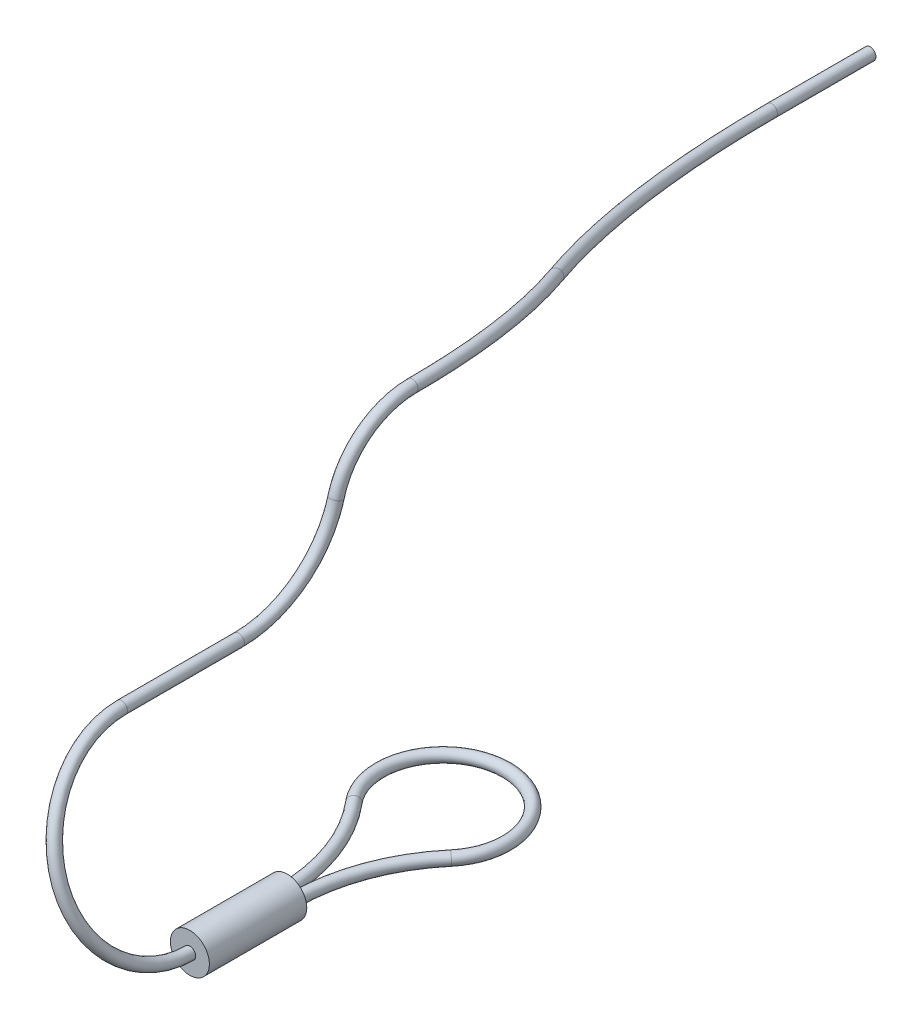
ISO-10303-21;
HEADER;
FILE_DESCRIPTION(('STEP AP214'),'2;1');
FILE_NAME('part.step','',(''),(''),'','','');
FILE_SCHEMA(('AUTOMOTIVE_DESIGN { 1 0 10303 214 1 1 1 1 }'));
ENDSEC;
DATA;
#1=APPLICATION_CONTEXT('core data for automotive mechanical design processes');
#2=APPLICATION_PROTOCOL_DEFINITION('international standard','automotive_design',2000,#1);
#3=PRODUCT_CONTEXT('',#1,'mechanical');
#4=PRODUCT('Part','Part','',(#3));
#5=PRODUCT_RELATED_PRODUCT_CATEGORY('part','',(#4));
#6=PRODUCT_DEFINITION_FORMATION('','',#4);
#7=PRODUCT_DEFINITION_CONTEXT('part definition',#1,'design');
#8=PRODUCT_DEFINITION('design','',#6,#7);
#9=PRODUCT_DEFINITION_SHAPE('','',#8);
#10=(LENGTH_UNIT() NAMED_UNIT(*) SI_UNIT(.MILLI.,.METRE.));
#11=(NAMED_UNIT(*) PLANE_ANGLE_UNIT() SI_UNIT($,.RADIAN.));
#12=(NAMED_UNIT(*) SI_UNIT($,.STERADIAN.) SOLID_ANGLE_UNIT());
#13=UNCERTAINTY_MEASURE_WITH_UNIT(LENGTH_MEASURE(1.E-05),#10,'distance_accuracy_value','');
#14=(GEOMETRIC_REPRESENTATION_CONTEXT(3) GLOBAL_UNCERTAINTY_ASSIGNED_CONTEXT((#13)) GLOBAL_UNIT_ASSIGNED_CONTEXT((#10,
#11,#12)) REPRESENTATION_CONTEXT('',''));
#15=CARTESIAN_POINT('',(0.,0.,0.));
#16=DIRECTION('',(0.,0.,1.));
#17=DIRECTION('',(1.,0.,0.));
#18=AXIS2_PLACEMENT_3D('',#15,#16,#17);
#19=CARTESIAN_POINT('',(10.,-13.,14.));
#20=DIRECTION('',(0.,0.,1.));
#21=DIRECTION('',(1.,0.,0.));
#22=AXIS2_PLACEMENT_3D('',#19,#20,#21);
#23=PLANE('',#22);
#24=CARTESIAN_POINT('',(10.,-13.,14.));
#25=DIRECTION('',(0.,0.,1.));
#26=DIRECTION('',(1.,0.,0.));
#27=AXIS2_PLACEMENT_3D('',#24,#25,#26);
#28=CIRCLE('',#27,0.999999999999999);
#29=CARTESIAN_POINT('',(11.,-13.,14.));
#30=VERTEX_POINT('',#29);
#31=EDGE_CURVE('E48',#30,#30,#28,.T.);
#32=ORIENTED_EDGE('',*,*,#31,.T.);
#33=EDGE_LOOP('',(#32));
#34=FACE_BOUND('',#33,.T.);
#35=CARTESIAN_POINT('',(10.,-13.,14.));
#36=DIRECTION('',(0.,0.,1.));
#37=DIRECTION('',(1.,0.,0.));
#38=AXIS2_PLACEMENT_3D('',#35,#36,#37);
#39=CIRCLE('',#38,0.3);
#40=CARTESIAN_POINT('',(10.1070441180227,-13.280252665994,14.));
#41=VERTEX_POINT('',#40);
#42=EDGE_CURVE('E57',#41,#41,#39,.T.);
#43=ORIENTED_EDGE('',*,*,#42,.F.);
#44=EDGE_LOOP('',(#43));
#45=FACE_BOUND('',#44,.T.);
#46=ADVANCED_FACE('F28',(#34,#45),#23,.T.);
#47=CARTESIAN_POINT('',(0.52232905982905,-13.,9.00000000000001));
#48=DIRECTION('',(0.,-1.,0.));
#49=DIRECTION('',(0.,0.,-1.));
#50=AXIS2_PLACEMENT_3D('',#47,#48,#49);
#51=TOROIDAL_SURFACE('',#50,9.15267094017095,0.3);
#52=CARTESIAN_POINT('',(7.5164679685414,-13.,3.09632264900209));
#53=DIRECTION('',(-0.645022353539104,0.,-0.764163701987261));
#54=DIRECTION('',(-0.764163701987261,0.,0.645022353539104));
#55=AXIS2_PLACEMENT_3D('',#52,#53,#54);
#56=CIRCLE('',#55,0.3);
#57=CARTESIAN_POINT('',(7.74571707913758,-13.,2.90281594294036));
#58=VERTEX_POINT('',#57);
#59=EDGE_CURVE('E10',#58,#58,#56,.T.);
#60=CARTESIAN_POINT('',(9.675,-13.,9.00000000000001));
#61=DIRECTION('',(0.,0.,1.));
#62=DIRECTION('',(1.,0.,0.));
#63=AXIS2_PLACEMENT_3D('',#60,#61,#62);
#64=CIRCLE('',#63,0.3);
#65=CARTESIAN_POINT('',(9.975,-13.,9.00000000000001));
#66=VERTEX_POINT('',#65);
#67=EDGE_CURVE('E43',#66,#66,#64,.T.);
#68=CARTESIAN_POINT('',(0.52232905982905,-13.,9.00000000000001));
#69=DIRECTION('',(0.,-1.,0.));
#70=DIRECTION('',(0.,0.,-1.));
#71=AXIS2_PLACEMENT_3D('',#68,#69,#70);
#72=CIRCLE('',#71,9.45267094017095);
#73=EDGE_CURVE('',#58,#66,#72,.T.);
#74=ORIENTED_EDGE('',*,*,#59,.F.);
#75=ORIENTED_EDGE('',*,*,#67,.F.);
#76=ORIENTED_EDGE('',*,*,#73,.T.);
#77=ORIENTED_EDGE('',*,*,#73,.F.);
#78=EDGE_LOOP('',(#74,#76,#75,#77));
#79=FACE_BOUND('',#78,.T.);
#80=ADVANCED_FACE('F30',(#79),#51,.T.);
#81=CARTESIAN_POINT('',(10.,-13.,1.));
#82=DIRECTION('',(0.,1.,0.));
#83=DIRECTION('',(0.,0.,1.));
#84=AXIS2_PLACEMENT_3D('',#81,#82,#83);
#85=TOROIDAL_SURFACE('',#84,3.25,0.3);
#86=CARTESIAN_POINT('',(12.4835320314586,-13.,3.09632264900206));
#87=DIRECTION('',(-0.645022353539095,0.,0.764163701987269));
#88=DIRECTION('',(0.764163701987269,0.,0.645022353539095));
#89=AXIS2_PLACEMENT_3D('',#86,#87,#88);
#90=CIRCLE('',#89,0.3);
#91=CARTESIAN_POINT('',(12.2542829208624,-13.,2.90281594294033));
#92=VERTEX_POINT('',#91);
#93=EDGE_CURVE('E35',#92,#92,#90,.T.);
#94=ORIENTED_EDGE('',*,*,#93,.F.);
#95=EDGE_LOOP('',(#94));
#96=FACE_BOUND('',#95,.T.);
#97=ORIENTED_EDGE('',*,*,#59,.T.);
#98=EDGE_LOOP('',(#97));
#99=FACE_BOUND('',#98,.T.);
#100=ADVANCED_FACE('F111',(#96,#99),#85,.T.);
#101=CARTESIAN_POINT('',(19.4776709401709,-13.,9.));
#102=DIRECTION('',(0.,1.,0.));
#103=DIRECTION('',(0.,0.,1.));
#104=AXIS2_PLACEMENT_3D('',#101,#102,#103);
#105=TOROIDAL_SURFACE('',#104,9.15267094017095,0.3);
#106=CARTESIAN_POINT('',(10.325,-13.,9.));
#107=DIRECTION('',(0.,0.,1.));
#108=DIRECTION('',(1.,0.,0.));
#109=AXIS2_PLACEMENT_3D('',#106,#107,#108);
#110=CIRCLE('',#109,0.3);
#111=CARTESIAN_POINT('',(10.025,-13.,9.));
#112=VERTEX_POINT('',#111);
#113=EDGE_CURVE('E39',#112,#112,#110,.T.);
#114=CARTESIAN_POINT('',(19.4776709401709,-13.,9.));
#115=DIRECTION('',(0.,1.,0.));
#116=DIRECTION('',(0.,0.,1.));
#117=AXIS2_PLACEMENT_3D('',#114,#115,#116);
#118=CIRCLE('',#117,9.45267094017095);
#119=EDGE_CURVE('',#92,#112,#118,.T.);
#120=ORIENTED_EDGE('',*,*,#93,.T.);
#121=ORIENTED_EDGE('',*,*,#113,.F.);
#122=ORIENTED_EDGE('',*,*,#119,.T.);
#123=ORIENTED_EDGE('',*,*,#119,.F.);
#124=EDGE_LOOP('',(#120,#122,#121,#123));
#125=FACE_BOUND('',#124,.T.);
#126=ADVANCED_FACE('F120',(#125),#105,.T.);
#127=CARTESIAN_POINT('',(10.,-13.,9.));
#128=DIRECTION('',(0.,0.,1.));
#129=DIRECTION('',(1.,0.,0.));
#130=AXIS2_PLACEMENT_3D('',#127,#128,#129);
#131=PLANE('',#130);
#132=CARTESIAN_POINT('',(10.,-13.,9.));
#133=DIRECTION('',(0.,0.,1.));
#134=DIRECTION('',(1.,0.,0.));
#135=AXIS2_PLACEMENT_3D('',#132,#133,#134);
#136=CIRCLE('',#135,0.999999999999999);
#137=CARTESIAN_POINT('',(11.,-13.,9.));
#138=VERTEX_POINT('',#137);
#139=EDGE_CURVE('E51',#138,#138,#136,.T.);
#140=ORIENTED_EDGE('',*,*,#139,.F.);
#141=EDGE_LOOP('',(#140));
#142=FACE_BOUND('',#141,.T.);
#143=ORIENTED_EDGE('',*,*,#113,.T.);
#144=EDGE_LOOP('',(#143));
#145=FACE_BOUND('',#144,.T.);
#146=ORIENTED_EDGE('',*,*,#67,.T.);
#147=EDGE_LOOP('',(#146));
#148=FACE_BOUND('',#147,.T.);
#149=ADVANCED_FACE('F116',(#142,#145,#148),#131,.F.);
#150=CARTESIAN_POINT('',(10.,-13.,14.));
#151=DIRECTION('',(0.,0.,-1.));
#152=DIRECTION('',(-1.,0.,0.));
#153=AXIS2_PLACEMENT_3D('',#150,#151,#152);
#154=CYLINDRICAL_SURFACE('',#153,0.999999999999999);
#155=ORIENTED_EDGE('',*,*,#31,.F.);
#156=EDGE_LOOP('',(#155));
#157=FACE_BOUND('',#156,.T.);
#158=ORIENTED_EDGE('',*,*,#139,.T.);
#159=EDGE_LOOP('',(#158));
#160=FACE_BOUND('',#159,.T.);
#161=ADVANCED_FACE('F102',(#157,#160),#154,.T.);
#162=CARTESIAN_POINT('',(8.25,-8.41831746994741,14.));
#163=DIRECTION('',(0.93417555331332,0.356813726742334,0.));
#164=DIRECTION('',(-0.356813726742334,0.93417555331332,0.));
#165=AXIS2_PLACEMENT_3D('',#162,#163,#164);
#166=TOROIDAL_SURFACE('',#165,4.90451983441693,0.3);
#167=CARTESIAN_POINT('',(6.5,-3.83663493989482,14.));
#168=DIRECTION('',(0.,0.,-1.));
#169=DIRECTION('',(0.745367928816494,0.666653321218615,0.));
#170=AXIS2_PLACEMENT_3D('',#167,#168,#169);
#171=CIRCLE('',#170,0.3);
#172=CARTESIAN_POINT('',(6.3929558819773,-3.55638227390083,14.));
#173=VERTEX_POINT('',#172);
#174=EDGE_CURVE('E54',#173,#173,#171,.T.);
#175=CARTESIAN_POINT('',(8.25,-8.41831746994741,14.));
#176=DIRECTION('',(0.93417555331332,0.356813726742334,0.));
#177=DIRECTION('',(-0.356813726742334,0.93417555331332,0.));
#178=AXIS2_PLACEMENT_3D('',#175,#176,#177);
#179=CIRCLE('',#178,5.20451983441693);
#180=EDGE_CURVE('',#173,#41,#179,.T.);
#181=ORIENTED_EDGE('',*,*,#174,.F.);
#182=ORIENTED_EDGE('',*,*,#42,.T.);
#183=ORIENTED_EDGE('',*,*,#180,.T.);
#184=ORIENTED_EDGE('',*,*,#180,.F.);
#185=EDGE_LOOP('',(#181,#183,#182,#184));
#186=FACE_BOUND('',#185,.T.);
#187=ADVANCED_FACE('F92',(#186),#166,.T.);
#188=CARTESIAN_POINT('',(6.5,-1.04759455862561,-0.909676118523621));
#189=DIRECTION('',(-1.,0.,0.));
#190=DIRECTION('',(0.,0.,1.));
#191=AXIS2_PLACEMENT_3D('',#188,#189,#190);
#192=TOROIDAL_SURFACE('',#191,4.04759455862563,0.300000000000023);
#193=CARTESIAN_POINT('',(6.5,0.,2.99999999999999));
#194=DIRECTION('',(0.,0.965925826289069,-0.258819045102518));
#195=DIRECTION('',(-1.,0.,0.));
#196=AXIS2_PLACEMENT_3D('',#193,#194,#195);
#197=CIRCLE('',#196,0.300000000000023);
#198=CARTESIAN_POINT('',(6.5,0.0776457135307405,3.28977774788674));
#199=VERTEX_POINT('',#198);
#200=EDGE_CURVE('E63',#199,#199,#197,.T.);
#201=CARTESIAN_POINT('',(6.5,3.00000000000003,-0.909676118523605));
#202=DIRECTION('',(0.,0.,-1.));
#203=DIRECTION('',(-1.,0.,0.));
#204=AXIS2_PLACEMENT_3D('',#201,#202,#203);
#205=CIRCLE('',#204,0.300000000000023);
#206=CARTESIAN_POINT('',(6.5,3.30000000000005,-0.909676118523603));
#207=VERTEX_POINT('',#206);
#208=EDGE_CURVE('E60',#207,#207,#205,.T.);
#209=CARTESIAN_POINT('',(6.5,-1.04759455862561,-0.909676118523621));
#210=DIRECTION('',(-1.,0.,0.));
#211=DIRECTION('',(0.,0.,1.));
#212=AXIS2_PLACEMENT_3D('',#209,#210,#211);
#213=CIRCLE('',#212,4.34759455862565);
#214=EDGE_CURVE('',#199,#207,#213,.T.);
#215=ORIENTED_EDGE('',*,*,#200,.T.);
#216=ORIENTED_EDGE('',*,*,#208,.F.);
#217=ORIENTED_EDGE('',*,*,#214,.T.);
#218=ORIENTED_EDGE('',*,*,#214,.F.);
#219=EDGE_LOOP('',(#215,#217,#216,#218));
#220=FACE_BOUND('',#219,.T.);
#221=ADVANCED_FACE('F89',(#220),#192,.T.);
#222=CARTESIAN_POINT('',(6.5,1.3397459621556,8.));
#223=DIRECTION('',(1.,0.,0.));
#224=DIRECTION('',(0.,0.,-1.));
#225=AXIS2_PLACEMENT_3D('',#222,#223,#224);
#226=TOROIDAL_SURFACE('',#225,5.17638090205042,0.300000000000023);
#227=CARTESIAN_POINT('',(6.5,-3.83663493989482,8.00000000000001));
#228=DIRECTION('',(0.,0.,-1.));
#229=DIRECTION('',(-1.,0.,0.));
#230=AXIS2_PLACEMENT_3D('',#227,#228,#229);
#231=CIRCLE('',#230,0.300000000000023);
#232=CARTESIAN_POINT('',(6.19999999999998,-3.83663493989482,8.00000000000001));
#233=VERTEX_POINT('',#232);
#234=EDGE_CURVE('E66',#233,#233,#231,.T.);
#235=ORIENTED_EDGE('',*,*,#234,.T.);
#236=EDGE_LOOP('',(#235));
#237=FACE_BOUND('',#236,.T.);
#238=ORIENTED_EDGE('',*,*,#200,.F.);
#239=EDGE_LOOP('',(#238));
#240=FACE_BOUND('',#239,.T.);
#241=ADVANCED_FACE('F91',(#237,#240),#226,.T.);
#242=CARTESIAN_POINT('',(6.5,-3.83663493989482,8.00000000000001));
#243=DIRECTION('',(0.,0.,1.));
#244=DIRECTION('',(0.,-1.,0.));
#245=AXIS2_PLACEMENT_3D('',#242,#243,#244);
#246=CYLINDRICAL_SURFACE('',#245,0.300000000000023);
#247=ORIENTED_EDGE('',*,*,#234,.F.);
#248=EDGE_LOOP('',(#247));
#249=FACE_BOUND('',#248,.T.);
#250=ORIENTED_EDGE('',*,*,#174,.T.);
#251=EDGE_LOOP('',(#250));
#252=FACE_BOUND('',#251,.T.);
#253=ADVANCED_FACE('F99',(#249,#252),#246,.T.);
#254=CARTESIAN_POINT('',(0.907959384500444,0.419058177461769,-24.9504513603309));
#255=DIRECTION('',(0.,0.,-1.));
#256=DIRECTION('',(-1.,0.,0.));
#257=AXIS2_PLACEMENT_3D('',#254,#255,#256);
#258=CYLINDRICAL_SURFACE('',#257,0.300000000000039);
#259=CARTESIAN_POINT('',(0.907959384500444,0.419058177461769,-24.9504513603309));
#260=DIRECTION('',(0.,0.,-1.));
#261=DIRECTION('',(0.,1.,0.));
#262=AXIS2_PLACEMENT_3D('',#259,#260,#261);
#263=CIRCLE('',#262,0.300000000000039);
#264=CARTESIAN_POINT('',(0.635571569150277,0.29334072422323,-24.9504513603309));
#265=VERTEX_POINT('',#264);
#266=EDGE_CURVE('E72',#265,#265,#263,.T.);
#267=ORIENTED_EDGE('',*,*,#266,.T.);
#268=EDGE_LOOP('',(#267));
#269=FACE_BOUND('',#268,.T.);
#270=CARTESIAN_POINT('',(0.907959384500451,0.419058177461773,-30.));
#271=DIRECTION('',(0.,0.,-1.));
#272=DIRECTION('',(0.,1.,0.));
#273=AXIS2_PLACEMENT_3D('',#270,#271,#272);
#274=CIRCLE('',#273,0.300000000000039);
#275=CARTESIAN_POINT('',(0.907959384500451,0.719058177461812,-30.));
#276=VERTEX_POINT('',#275);
#277=EDGE_CURVE('E69',#276,#276,#274,.T.);
#278=ORIENTED_EDGE('',*,*,#277,.F.);
#279=EDGE_LOOP('',(#278));
#280=FACE_BOUND('',#279,.T.);
#281=ADVANCED_FACE('F167',(#269,#280),#258,.T.);
#282=CARTESIAN_POINT('',(28.146740919514,12.9908035013142,-24.9504513603309));
#283=DIRECTION('',(0.419058177461747,-0.907959384500452,0.));
#284=DIRECTION('',(0.907959384500452,0.419058177461747,0.));
#285=AXIS2_PLACEMENT_3D('',#282,#283,#284);
#286=TOROIDAL_SURFACE('',#285,30.,0.300000000000039);
#287=CARTESIAN_POINT('',(4.26318375380018,1.96762327098473,-10.5259862152465));
#288=DIRECTION('',(-0.4365609498293,-0.201489669151993,-0.876821789367235));
#289=DIRECTION('',(-0.0468678069724697,0.978368704474245,-0.201489669151992));
#290=AXIS2_PLACEMENT_3D('',#287,#288,#289);
#291=CIRCLE('',#290,0.300000000000039);
#292=CARTESIAN_POINT('',(4.02434818214302,1.85739146868142,-10.3817415637957));
#293=VERTEX_POINT('',#292);
#294=EDGE_CURVE('E75',#293,#293,#291,.T.);
#295=CARTESIAN_POINT('',(28.146740919514,12.9908035013142,-24.9504513603309));
#296=DIRECTION('',(0.419058177461747,-0.907959384500452,0.));
#297=DIRECTION('',(0.907959384500452,0.419058177461747,0.));
#298=AXIS2_PLACEMENT_3D('',#295,#296,#297);
#299=CIRCLE('',#298,30.3);
#300=EDGE_CURVE('',#293,#265,#299,.T.);
#301=ORIENTED_EDGE('',*,*,#294,.T.);
#302=ORIENTED_EDGE('',*,*,#266,.F.);
#303=ORIENTED_EDGE('',*,*,#300,.T.);
#304=ORIENTED_EDGE('',*,*,#300,.F.);
#305=EDGE_LOOP('',(#301,#303,#302,#304));
#306=FACE_BOUND('',#305,.T.);
#307=ADVANCED_FACE('F79',(#306),#286,.T.);
#308=CARTESIAN_POINT('',(-11.659187690009,-5.38116354923492,-0.90967611852362));
#309=DIRECTION('',(0.419058177461747,-0.907959384500452,0.));
#310=DIRECTION('',(0.907959384500452,0.419058177461747,0.));
#311=AXIS2_PLACEMENT_3D('',#308,#309,#310);
#312=TOROIDAL_SURFACE('',#311,20.,0.300000000000039);
#313=ORIENTED_EDGE('',*,*,#294,.F.);
#314=EDGE_LOOP('',(#313));
#315=FACE_BOUND('',#314,.T.);
#316=ORIENTED_EDGE('',*,*,#208,.T.);
#317=EDGE_LOOP('',(#316));
#318=FACE_BOUND('',#317,.T.);
#319=ADVANCED_FACE('F82',(#315,#318),#312,.T.);
#320=CARTESIAN_POINT('',(0.907959384500451,0.419058177461772,-30.));
#321=DIRECTION('',(0.,0.,-1.));
#322=DIRECTION('',(0.,1.,0.));
#323=AXIS2_PLACEMENT_3D('',#320,#321,#322);
#324=PLANE('',#323);
#325=ORIENTED_EDGE('',*,*,#277,.T.);
#326=EDGE_LOOP('',(#325));
#327=FACE_BOUND('',#326,.T.);
#328=ADVANCED_FACE('F85',(#327),#324,.T.);
#329=CLOSED_SHELL('',(#46,#80,#100,#126,#149,#161,#187,#221,#241,#253,#281,#307,#319,#328));
#330=MANIFOLD_SOLID_BREP('B2',#329);
#331=ADVANCED_BREP_SHAPE_REPRESENTATION('',(#18,#330),#14);
#332=SHAPE_DEFINITION_REPRESENTATION(#9,#331);
ENDSEC;
END-ISO-10303-21;
